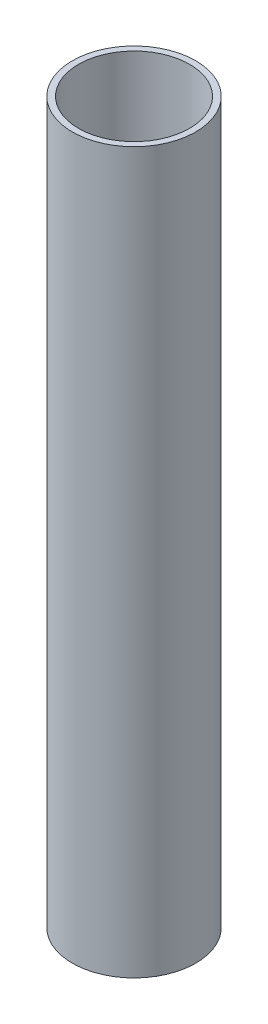
ISO-10303-21;
HEADER;
FILE_DESCRIPTION(('STEP AP214'),'2;1');
FILE_NAME('part.step','',(''),(''),'','','');
FILE_SCHEMA(('AUTOMOTIVE_DESIGN { 1 0 10303 214 1 1 1 1 }'));
ENDSEC;
DATA;
#1=APPLICATION_CONTEXT('core data for automotive mechanical design processes');
#2=APPLICATION_PROTOCOL_DEFINITION('international standard','automotive_design',2000,#1);
#3=PRODUCT_CONTEXT('',#1,'mechanical');
#4=PRODUCT('Part','Part','',(#3));
#5=PRODUCT_RELATED_PRODUCT_CATEGORY('part','',(#4));
#6=PRODUCT_DEFINITION_FORMATION('','',#4);
#7=PRODUCT_DEFINITION_CONTEXT('part definition',#1,'design');
#8=PRODUCT_DEFINITION('design','',#6,#7);
#9=PRODUCT_DEFINITION_SHAPE('','',#8);
#10=(LENGTH_UNIT() NAMED_UNIT(*) SI_UNIT(.MILLI.,.METRE.));
#11=(NAMED_UNIT(*) PLANE_ANGLE_UNIT() SI_UNIT($,.RADIAN.));
#12=(NAMED_UNIT(*) SI_UNIT($,.STERADIAN.) SOLID_ANGLE_UNIT());
#13=UNCERTAINTY_MEASURE_WITH_UNIT(LENGTH_MEASURE(1.E-05),#10,'distance_accuracy_value','');
#14=(GEOMETRIC_REPRESENTATION_CONTEXT(3) GLOBAL_UNCERTAINTY_ASSIGNED_CONTEXT((#13)) GLOBAL_UNIT_ASSIGNED_CONTEXT((#10,
#11,#12)) REPRESENTATION_CONTEXT('',''));
#15=CARTESIAN_POINT('',(0.,0.,0.));
#16=DIRECTION('',(0.,0.,1.));
#17=DIRECTION('',(1.,0.,0.));
#18=AXIS2_PLACEMENT_3D('',#15,#16,#17);
#19=CARTESIAN_POINT('',(0.,350.,0.));
#20=DIRECTION('',(0.,-1.,0.));
#21=DIRECTION('',(0.,0.,-1.));
#22=AXIS2_PLACEMENT_3D('',#19,#20,#21);
#23=CYLINDRICAL_SURFACE('',#22,30.);
#24=CARTESIAN_POINT('',(0.,0.,0.));
#25=DIRECTION('',(0.,-1.,0.));
#26=DIRECTION('',(0.,0.,-1.));
#27=AXIS2_PLACEMENT_3D('',#24,#25,#26);
#28=CIRCLE('',#27,30.);
#29=CARTESIAN_POINT('',(0.,0.,-30.));
#30=VERTEX_POINT('',#29);
#31=EDGE_CURVE('E28',#30,#30,#28,.T.);
#32=ORIENTED_EDGE('',*,*,#31,.F.);
#33=EDGE_LOOP('',(#32));
#34=FACE_BOUND('',#33,.T.);
#35=CARTESIAN_POINT('',(0.,350.,0.));
#36=DIRECTION('',(0.,-1.,0.));
#37=DIRECTION('',(0.,0.,-1.));
#38=AXIS2_PLACEMENT_3D('',#35,#36,#37);
#39=CIRCLE('',#38,30.);
#40=CARTESIAN_POINT('',(0.,350.,-30.));
#41=VERTEX_POINT('',#40);
#42=EDGE_CURVE('E19',#41,#41,#39,.F.);
#43=ORIENTED_EDGE('',*,*,#42,.F.);
#44=EDGE_LOOP('',(#43));
#45=FACE_BOUND('',#44,.T.);
#46=ADVANCED_FACE('F15',(#34,#45),#23,.T.);
#47=CARTESIAN_POINT('',(-30.01,350.,30.01));
#48=DIRECTION('',(0.,1.,0.));
#49=DIRECTION('',(1.,0.,0.));
#50=AXIS2_PLACEMENT_3D('',#47,#48,#49);
#51=PLANE('',#50);
#52=CARTESIAN_POINT('',(0.,350.,0.));
#53=DIRECTION('',(0.,1.,0.));
#54=DIRECTION('',(0.,0.,1.));
#55=AXIS2_PLACEMENT_3D('',#52,#53,#54);
#56=CIRCLE('',#55,27.);
#57=CARTESIAN_POINT('',(0.,350.,27.));
#58=VERTEX_POINT('',#57);
#59=EDGE_CURVE('E23',#58,#58,#56,.T.);
#60=ORIENTED_EDGE('',*,*,#59,.F.);
#61=EDGE_LOOP('',(#60));
#62=FACE_BOUND('',#61,.T.);
#63=ORIENTED_EDGE('',*,*,#42,.T.);
#64=EDGE_LOOP('',(#63));
#65=FACE_BOUND('',#64,.T.);
#66=ADVANCED_FACE('F36',(#62,#65),#51,.T.);
#67=CARTESIAN_POINT('',(30.01,0.,30.01));
#68=DIRECTION('',(0.,-1.,0.));
#69=DIRECTION('',(-1.,0.,0.));
#70=AXIS2_PLACEMENT_3D('',#67,#68,#69);
#71=PLANE('',#70);
#72=CARTESIAN_POINT('',(0.,0.,0.));
#73=DIRECTION('',(0.,1.,0.));
#74=DIRECTION('',(0.,0.,1.));
#75=AXIS2_PLACEMENT_3D('',#72,#73,#74);
#76=CIRCLE('',#75,27.);
#77=CARTESIAN_POINT('',(0.,0.,27.));
#78=VERTEX_POINT('',#77);
#79=EDGE_CURVE('E10',#78,#78,#76,.F.);
#80=ORIENTED_EDGE('',*,*,#79,.F.);
#81=EDGE_LOOP('',(#80));
#82=FACE_BOUND('',#81,.T.);
#83=ORIENTED_EDGE('',*,*,#31,.T.);
#84=EDGE_LOOP('',(#83));
#85=FACE_BOUND('',#84,.T.);
#86=ADVANCED_FACE('F45',(#82,#85),#71,.T.);
#87=CARTESIAN_POINT('',(0.,0.,0.));
#88=DIRECTION('',(0.,1.,0.));
#89=DIRECTION('',(0.,0.,1.));
#90=AXIS2_PLACEMENT_3D('',#87,#88,#89);
#91=CYLINDRICAL_SURFACE('',#90,27.);
#92=ORIENTED_EDGE('',*,*,#79,.T.);
#93=EDGE_LOOP('',(#92));
#94=FACE_BOUND('',#93,.T.);
#95=ORIENTED_EDGE('',*,*,#59,.T.);
#96=EDGE_LOOP('',(#95));
#97=FACE_BOUND('',#96,.T.);
#98=ADVANCED_FACE('F17',(#94,#97),#91,.F.);
#99=CLOSED_SHELL('',(#46,#66,#86,#98));
#100=MANIFOLD_SOLID_BREP('B1',#99);
#101=ADVANCED_BREP_SHAPE_REPRESENTATION('',(#18,#100),#14);
#102=SHAPE_DEFINITION_REPRESENTATION(#9,#101);
ENDSEC;
END-ISO-10303-21;
